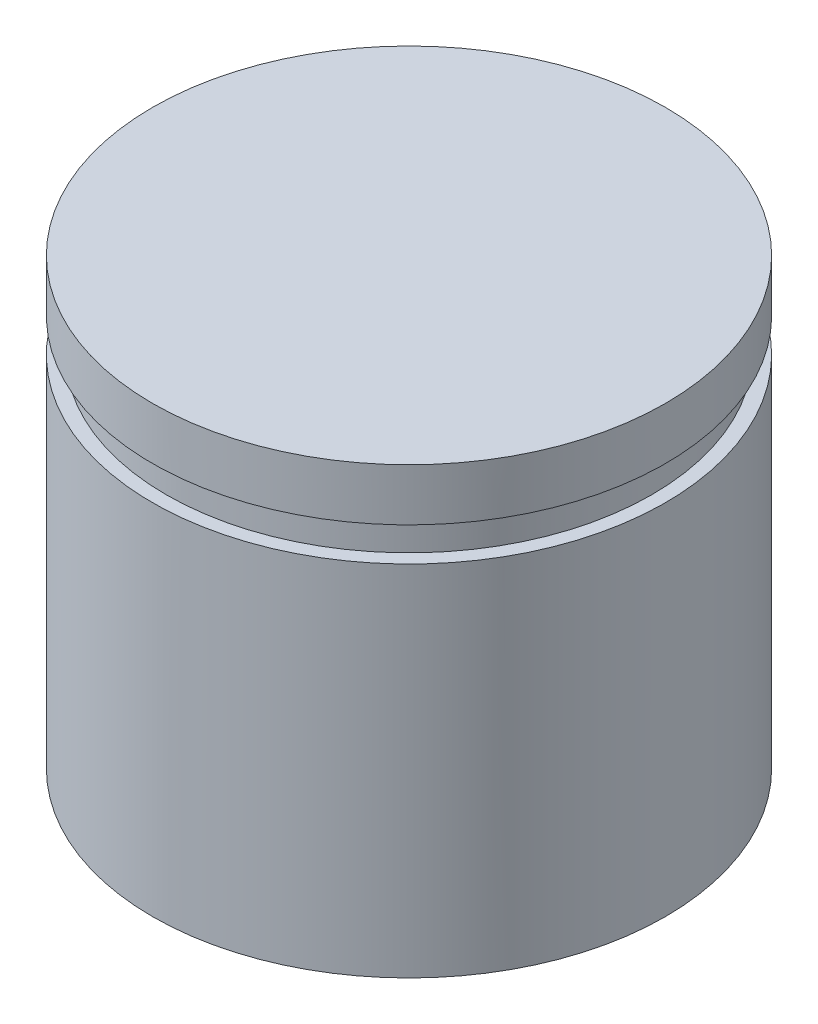
ISO-10303-21;
HEADER;
FILE_DESCRIPTION(('STEP AP214'),'2;1');
FILE_NAME('part.step','',(''),(''),'','','');
FILE_SCHEMA(('AUTOMOTIVE_DESIGN { 1 0 10303 214 1 1 1 1 }'));
ENDSEC;
DATA;
#1=APPLICATION_CONTEXT('core data for automotive mechanical design processes');
#2=APPLICATION_PROTOCOL_DEFINITION('international standard','automotive_design',2000,#1);
#3=PRODUCT_CONTEXT('',#1,'mechanical');
#4=PRODUCT('Part','Part','',(#3));
#5=PRODUCT_RELATED_PRODUCT_CATEGORY('part','',(#4));
#6=PRODUCT_DEFINITION_FORMATION('','',#4);
#7=PRODUCT_DEFINITION_CONTEXT('part definition',#1,'design');
#8=PRODUCT_DEFINITION('design','',#6,#7);
#9=PRODUCT_DEFINITION_SHAPE('','',#8);
#10=(LENGTH_UNIT() NAMED_UNIT(*) SI_UNIT(.MILLI.,.METRE.));
#11=(NAMED_UNIT(*) PLANE_ANGLE_UNIT() SI_UNIT($,.RADIAN.));
#12=(NAMED_UNIT(*) SI_UNIT($,.STERADIAN.) SOLID_ANGLE_UNIT());
#13=UNCERTAINTY_MEASURE_WITH_UNIT(LENGTH_MEASURE(1.E-05),#10,'distance_accuracy_value','');
#14=(GEOMETRIC_REPRESENTATION_CONTEXT(3) GLOBAL_UNCERTAINTY_ASSIGNED_CONTEXT((#13)) GLOBAL_UNIT_ASSIGNED_CONTEXT((#10,
#11,#12)) REPRESENTATION_CONTEXT('',''));
#15=CARTESIAN_POINT('',(0.,0.,0.));
#16=DIRECTION('',(0.,0.,1.));
#17=DIRECTION('',(1.,0.,0.));
#18=AXIS2_PLACEMENT_3D('',#15,#16,#17);
#19=CARTESIAN_POINT('',(0.,13.,0.));
#20=DIRECTION('',(0.,-1.,0.));
#21=DIRECTION('',(0.,0.,-1.));
#22=AXIS2_PLACEMENT_3D('',#19,#20,#21);
#23=CYLINDRICAL_SURFACE('',#22,7.5);
#24=CARTESIAN_POINT('',(0.,10.4854,0.));
#25=DIRECTION('',(0.,-1.,0.));
#26=DIRECTION('',(0.,0.,-1.));
#27=AXIS2_PLACEMENT_3D('',#24,#25,#26);
#28=CIRCLE('',#27,7.5);
#29=CARTESIAN_POINT('',(0.,10.4854,-7.5));
#30=VERTEX_POINT('',#29);
#31=EDGE_CURVE('E33',#30,#30,#28,.T.);
#32=ORIENTED_EDGE('',*,*,#31,.T.);
#33=EDGE_LOOP('',(#32));
#34=FACE_BOUND('',#33,.T.);
#35=CARTESIAN_POINT('',(0.,0.,0.));
#36=DIRECTION('',(0.,1.,0.));
#37=DIRECTION('',(0.,0.,1.));
#38=AXIS2_PLACEMENT_3D('',#35,#36,#37);
#39=CIRCLE('',#38,7.5);
#40=CARTESIAN_POINT('',(0.,0.,7.5));
#41=VERTEX_POINT('',#40);
#42=EDGE_CURVE('E37',#41,#41,#39,.T.);
#43=ORIENTED_EDGE('',*,*,#42,.T.);
#44=EDGE_LOOP('',(#43));
#45=FACE_BOUND('',#44,.T.);
#46=ADVANCED_FACE('F30',(#34,#45),#23,.T.);
#47=CARTESIAN_POINT('',(0.,0.,0.));
#48=DIRECTION('',(0.,1.,0.));
#49=DIRECTION('',(0.,0.,1.));
#50=AXIS2_PLACEMENT_3D('',#47,#48,#49);
#51=PLANE('',#50);
#52=ORIENTED_EDGE('',*,*,#42,.F.);
#53=EDGE_LOOP('',(#52));
#54=FACE_BOUND('',#53,.T.);
#55=ADVANCED_FACE('F74',(#54),#51,.F.);
#56=CARTESIAN_POINT('',(0.,10.4854,0.));
#57=DIRECTION('',(0.,-1.,0.));
#58=DIRECTION('',(0.,0.,-1.));
#59=AXIS2_PLACEMENT_3D('',#56,#57,#58);
#60=PLANE('',#59);
#61=CARTESIAN_POINT('',(0.,10.4854,0.));
#62=DIRECTION('',(0.,1.,0.));
#63=DIRECTION('',(0.,0.,1.));
#64=AXIS2_PLACEMENT_3D('',#61,#62,#63);
#65=CIRCLE('',#64,7.0993);
#66=CARTESIAN_POINT('',(0.,10.4854,7.0993));
#67=VERTEX_POINT('',#66);
#68=EDGE_CURVE('E48',#67,#67,#65,.T.);
#69=ORIENTED_EDGE('',*,*,#68,.F.);
#70=EDGE_LOOP('',(#69));
#71=FACE_BOUND('',#70,.T.);
#72=ORIENTED_EDGE('',*,*,#31,.F.);
#73=EDGE_LOOP('',(#72));
#74=FACE_BOUND('',#73,.T.);
#75=ADVANCED_FACE('F70',(#71,#74),#60,.F.);
#76=CARTESIAN_POINT('',(0.,11.476,0.));
#77=DIRECTION('',(0.,-1.,0.));
#78=DIRECTION('',(0.,0.,-1.));
#79=AXIS2_PLACEMENT_3D('',#76,#77,#78);
#80=PLANE('',#79);
#81=CARTESIAN_POINT('',(0.,11.476,0.));
#82=DIRECTION('',(0.,1.,0.));
#83=DIRECTION('',(0.,0.,1.));
#84=AXIS2_PLACEMENT_3D('',#81,#82,#83);
#85=CIRCLE('',#84,7.0993);
#86=CARTESIAN_POINT('',(0.,11.476,7.0993));
#87=VERTEX_POINT('',#86);
#88=EDGE_CURVE('E44',#87,#87,#85,.T.);
#89=ORIENTED_EDGE('',*,*,#88,.T.);
#90=EDGE_LOOP('',(#89));
#91=FACE_BOUND('',#90,.T.);
#92=CARTESIAN_POINT('',(0.,11.476,0.));
#93=DIRECTION('',(0.,-1.,0.));
#94=DIRECTION('',(0.,0.,-1.));
#95=AXIS2_PLACEMENT_3D('',#92,#93,#94);
#96=CIRCLE('',#95,7.5);
#97=CARTESIAN_POINT('',(0.,11.476,-7.5));
#98=VERTEX_POINT('',#97);
#99=EDGE_CURVE('E46',#98,#98,#96,.T.);
#100=ORIENTED_EDGE('',*,*,#99,.T.);
#101=EDGE_LOOP('',(#100));
#102=FACE_BOUND('',#101,.T.);
#103=ADVANCED_FACE('F58',(#91,#102),#80,.T.);
#104=CARTESIAN_POINT('',(0.,10.4854,0.));
#105=DIRECTION('',(0.,1.,0.));
#106=DIRECTION('',(0.,0.,1.));
#107=AXIS2_PLACEMENT_3D('',#104,#105,#106);
#108=CYLINDRICAL_SURFACE('',#107,7.0993);
#109=ORIENTED_EDGE('',*,*,#68,.T.);
#110=EDGE_LOOP('',(#109));
#111=FACE_BOUND('',#110,.T.);
#112=ORIENTED_EDGE('',*,*,#88,.F.);
#113=EDGE_LOOP('',(#112));
#114=FACE_BOUND('',#113,.T.);
#115=ADVANCED_FACE('F60',(#111,#114),#108,.T.);
#116=CARTESIAN_POINT('',(0.,13.,0.));
#117=DIRECTION('',(0.,1.,0.));
#118=DIRECTION('',(0.,0.,1.));
#119=AXIS2_PLACEMENT_3D('',#116,#117,#118);
#120=PLANE('',#119);
#121=CARTESIAN_POINT('',(0.,13.,0.));
#122=DIRECTION('',(0.,1.,0.));
#123=DIRECTION('',(0.,0.,1.));
#124=AXIS2_PLACEMENT_3D('',#121,#122,#123);
#125=CIRCLE('',#124,7.5);
#126=CARTESIAN_POINT('',(0.,13.,7.5));
#127=VERTEX_POINT('',#126);
#128=EDGE_CURVE('E10',#127,#127,#125,.T.);
#129=ORIENTED_EDGE('',*,*,#128,.T.);
#130=EDGE_LOOP('',(#129));
#131=FACE_BOUND('',#130,.T.);
#132=ADVANCED_FACE('F62',(#131),#120,.T.);
#133=ORIENTED_EDGE('',*,*,#128,.F.);
#134=EDGE_LOOP('',(#133));
#135=FACE_BOUND('',#134,.T.);
#136=ORIENTED_EDGE('',*,*,#99,.F.);
#137=EDGE_LOOP('',(#136));
#138=FACE_BOUND('',#137,.T.);
#139=ADVANCED_FACE('F68',(#135,#138),#23,.T.);
#140=CLOSED_SHELL('',(#46,#55,#75,#103,#115,#132,#139));
#141=MANIFOLD_SOLID_BREP('B2',#140);
#142=ADVANCED_BREP_SHAPE_REPRESENTATION('',(#18,#141),#14);
#143=SHAPE_DEFINITION_REPRESENTATION(#9,#142);
ENDSEC;
END-ISO-10303-21;
